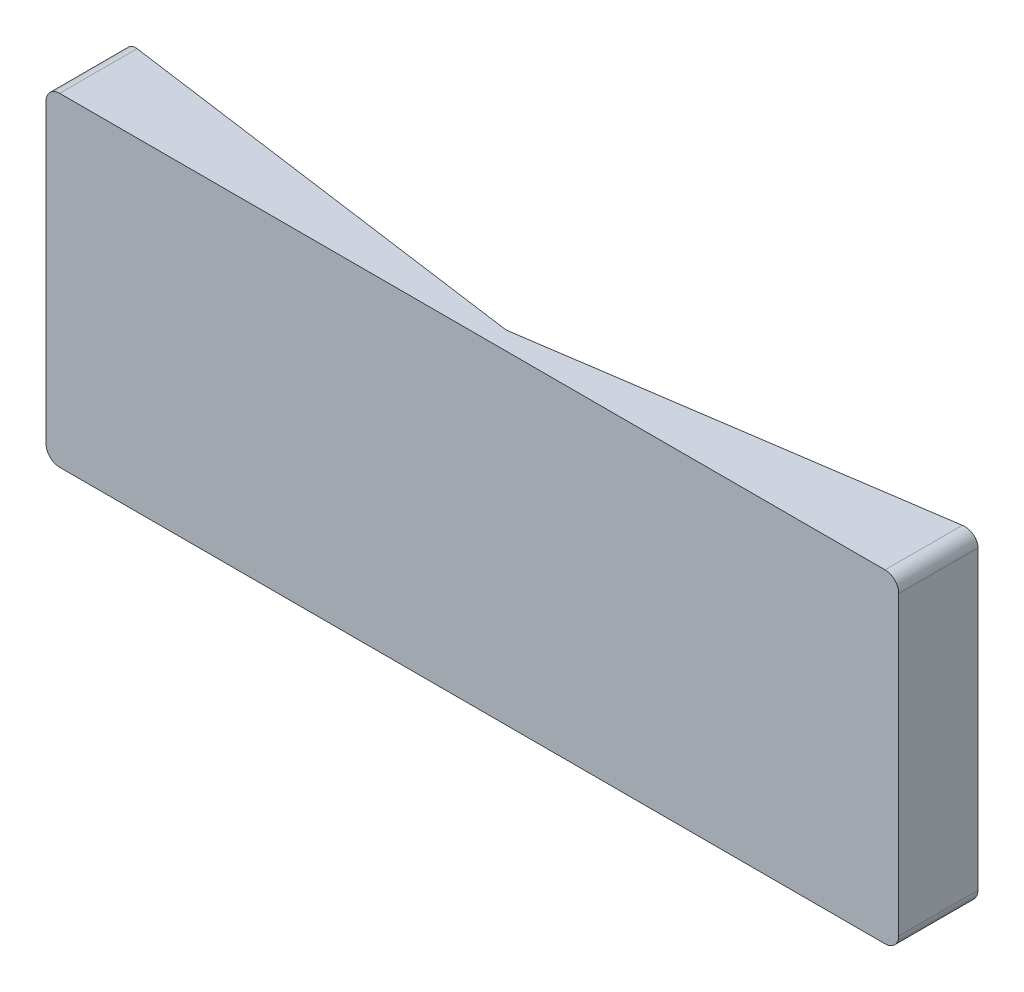
ISO-10303-21;
HEADER;
FILE_DESCRIPTION(('STEP AP214'),'2;1');
FILE_NAME('part.step','',(''),(''),'','','');
FILE_SCHEMA(('AUTOMOTIVE_DESIGN { 1 0 10303 214 1 1 1 1 }'));
ENDSEC;
DATA;
#1=APPLICATION_CONTEXT('core data for automotive mechanical design processes');
#2=APPLICATION_PROTOCOL_DEFINITION('international standard','automotive_design',2000,#1);
#3=PRODUCT_CONTEXT('',#1,'mechanical');
#4=PRODUCT('Part','Part','',(#3));
#5=PRODUCT_RELATED_PRODUCT_CATEGORY('part','',(#4));
#6=PRODUCT_DEFINITION_FORMATION('','',#4);
#7=PRODUCT_DEFINITION_CONTEXT('part definition',#1,'design');
#8=PRODUCT_DEFINITION('design','',#6,#7);
#9=PRODUCT_DEFINITION_SHAPE('','',#8);
#10=(LENGTH_UNIT() NAMED_UNIT(*) SI_UNIT(.MILLI.,.METRE.));
#11=(NAMED_UNIT(*) PLANE_ANGLE_UNIT() SI_UNIT($,.RADIAN.));
#12=(NAMED_UNIT(*) SI_UNIT($,.STERADIAN.) SOLID_ANGLE_UNIT());
#13=UNCERTAINTY_MEASURE_WITH_UNIT(LENGTH_MEASURE(1.E-05),#10,'distance_accuracy_value','');
#14=(GEOMETRIC_REPRESENTATION_CONTEXT(3) GLOBAL_UNCERTAINTY_ASSIGNED_CONTEXT((#13)) GLOBAL_UNIT_ASSIGNED_CONTEXT((#10,
#11,#12)) REPRESENTATION_CONTEXT('',''));
#15=CARTESIAN_POINT('',(0.,0.,0.));
#16=DIRECTION('',(0.,0.,1.));
#17=DIRECTION('',(1.,0.,0.));
#18=AXIS2_PLACEMENT_3D('',#15,#16,#17);
#19=CARTESIAN_POINT('',(73.8196902050114,-2.54,14.732));
#20=DIRECTION('',(0.,0.,-1.));
#21=DIRECTION('',(-1.,0.,0.));
#22=AXIS2_PLACEMENT_3D('',#19,#20,#21);
#23=CYLINDRICAL_SURFACE('',#22,2.54);
#24=CARTESIAN_POINT('',(73.8196902050114,-2.54,0.377191341160366));
#25=DIRECTION('',(-0.146889724137514,0.,-0.989152874404561));
#26=DIRECTION('',(0.989152874404561,0.,-0.146889724137514));
#27=AXIS2_PLACEMENT_3D('',#24,#25,#26);
#28=ELLIPSE('',#27,2.56785383303769,2.54);
#29=CARTESIAN_POINT('',(73.8196902050114,0.,0.37719134116037));
#30=VERTEX_POINT('',#29);
#31=CARTESIAN_POINT('',(76.3596902050114,-2.54000000000001,0.));
#32=VERTEX_POINT('',#31);
#33=EDGE_CURVE('E179',#30,#32,#28,.T.);
#34=ORIENTED_EDGE('',*,*,#33,.F.);
#35=DIRECTION('',(0.,0.,-1.));
#36=VECTOR('',#35,1.);
#37=CARTESIAN_POINT('',(73.8196902050114,0.,14.732));
#38=LINE('',#37,#36);
#39=CARTESIAN_POINT('',(73.8196902050114,0.,14.732));
#40=VERTEX_POINT('',#39);
#41=EDGE_CURVE('E165',#40,#30,#38,.T.);
#42=ORIENTED_EDGE('',*,*,#41,.F.);
#43=CARTESIAN_POINT('',(73.8196902050114,-2.54,14.732));
#44=DIRECTION('',(0.,0.,1.));
#45=DIRECTION('',(1.,0.,0.));
#46=AXIS2_PLACEMENT_3D('',#43,#44,#45);
#47=CIRCLE('',#46,2.54);
#48=CARTESIAN_POINT('',(76.3596902050114,-2.54000000000002,14.732));
#49=VERTEX_POINT('',#48);
#50=EDGE_CURVE('E151',#49,#40,#47,.T.);
#51=ORIENTED_EDGE('',*,*,#50,.F.);
#52=DIRECTION('',(0.,0.,-1.));
#53=VECTOR('',#52,1.);
#54=CARTESIAN_POINT('',(76.3596902050114,-2.54000000000002,14.732));
#55=LINE('',#54,#53);
#56=EDGE_CURVE('E141',#49,#32,#55,.T.);
#57=ORIENTED_EDGE('',*,*,#56,.T.);
#58=EDGE_LOOP('',(#34,#42,#51,#57));
#59=FACE_BOUND('',#58,.T.);
#60=ADVANCED_FACE('F38',(#59),#23,.T.);
#61=CARTESIAN_POINT('',(-79.5963097949886,0.,14.732));
#62=DIRECTION('',(0.,-1.,0.));
#63=DIRECTION('',(0.,0.,-1.));
#64=AXIS2_PLACEMENT_3D('',#61,#62,#63);
#65=PLANE('',#64);
#66=DIRECTION('',(0.989152874404561,0.,-0.146889724137514));
#67=VECTOR('',#66,1.);
#68=CARTESIAN_POINT('',(-78.3718174195553,0.,22.9777105829431));
#69=LINE('',#68,#67);
#70=CARTESIAN_POINT('',(0.,5.99999999337242E-06,11.3394543145741));
#71=VERTEX_POINT('',#70);
#72=EDGE_CURVE('E176',#71,#30,#69,.T.);
#73=ORIENTED_EDGE('',*,*,#72,.F.);
#74=DIRECTION('',(0.990604294125408,0.,0.136759396241361));
#75=VECTOR('',#74,1.);
#76=CARTESIAN_POINT('',(-77.6480062250653,0.,0.619639638159038));
#77=LINE('',#76,#75);
#78=CARTESIAN_POINT('',(-79.5963097949886,0.,0.350663598485353));
#79=VERTEX_POINT('',#78);
#80=EDGE_CURVE('E170',#79,#71,#77,.T.);
#81=ORIENTED_EDGE('',*,*,#80,.F.);
#82=DIRECTION('',(0.,0.,-1.));
#83=VECTOR('',#82,1.);
#84=CARTESIAN_POINT('',(-79.5963097949886,0.,14.732));
#85=LINE('',#84,#83);
#86=CARTESIAN_POINT('',(-79.5963097949886,0.,14.732));
#87=VERTEX_POINT('',#86);
#88=EDGE_CURVE('E162',#87,#79,#85,.T.);
#89=ORIENTED_EDGE('',*,*,#88,.F.);
#90=DIRECTION('',(-1.,0.,0.));
#91=VECTOR('',#90,1.);
#92=CARTESIAN_POINT('',(-79.5963097949886,0.,14.732));
#93=LINE('',#92,#91);
#94=EDGE_CURVE('E224',#40,#87,#93,.T.);
#95=ORIENTED_EDGE('',*,*,#94,.F.);
#96=ORIENTED_EDGE('',*,*,#41,.T.);
#97=EDGE_LOOP('',(#73,#81,#89,#95,#96));
#98=FACE_BOUND('',#97,.T.);
#99=ADVANCED_FACE('F218',(#98),#65,.F.);
#100=CARTESIAN_POINT('',(-79.5963097949886,-2.54,14.732));
#101=DIRECTION('',(0.,0.,-1.));
#102=DIRECTION('',(-1.,0.,0.));
#103=AXIS2_PLACEMENT_3D('',#100,#101,#102);
#104=CYLINDRICAL_SURFACE('',#103,2.54);
#105=CARTESIAN_POINT('',(-79.5963097949886,-2.54,0.350663598485351));
#106=DIRECTION('',(0.136759396241361,0.,-0.990604294125408));
#107=DIRECTION('',(-0.990604294125408,0.,-0.136759396241361));
#108=AXIS2_PLACEMENT_3D('',#105,#106,#107);
#109=ELLIPSE('',#108,2.56409144909122,2.54);
#110=CARTESIAN_POINT('',(-82.1363097949886,-2.54000000000003,0.));
#111=VERTEX_POINT('',#110);
#112=EDGE_CURVE('E174',#111,#79,#109,.T.);
#113=ORIENTED_EDGE('',*,*,#112,.F.);
#114=DIRECTION('',(0.,0.,-1.));
#115=VECTOR('',#114,1.);
#116=CARTESIAN_POINT('',(-82.1363097949886,-2.54000000000002,14.732));
#117=LINE('',#116,#115);
#118=CARTESIAN_POINT('',(-82.1363097949886,-2.54000000000002,14.732));
#119=VERTEX_POINT('',#118);
#120=EDGE_CURVE('E159',#119,#111,#117,.T.);
#121=ORIENTED_EDGE('',*,*,#120,.F.);
#122=CARTESIAN_POINT('',(-79.5963097949886,-2.54,14.732));
#123=DIRECTION('',(0.,0.,1.));
#124=DIRECTION('',(1.,0.,0.));
#125=AXIS2_PLACEMENT_3D('',#122,#123,#124);
#126=CIRCLE('',#125,2.54);
#127=EDGE_CURVE('E221',#87,#119,#126,.T.);
#128=ORIENTED_EDGE('',*,*,#127,.F.);
#129=ORIENTED_EDGE('',*,*,#88,.T.);
#130=EDGE_LOOP('',(#113,#121,#128,#129));
#131=FACE_BOUND('',#130,.T.);
#132=ADVANCED_FACE('F220',(#131),#104,.T.);
#133=CARTESIAN_POINT('',(-79.5963097949886,-57.658,14.732));
#134=DIRECTION('',(0.,0.,-1.));
#135=DIRECTION('',(-1.,0.,0.));
#136=AXIS2_PLACEMENT_3D('',#133,#134,#135);
#137=CYLINDRICAL_SURFACE('',#136,2.54);
#138=CARTESIAN_POINT('',(-79.5963097949886,-57.658,0.350663598485354));
#139=DIRECTION('',(0.136759396241361,0.,-0.990604294125408));
#140=DIRECTION('',(-0.990604294125408,0.,-0.136759396241361));
#141=AXIS2_PLACEMENT_3D('',#138,#139,#140);
#142=ELLIPSE('',#141,2.56409144909122,2.54);
#143=CARTESIAN_POINT('',(-79.5963097949885,-60.198,0.350663598485358));
#144=VERTEX_POINT('',#143);
#145=CARTESIAN_POINT('',(-82.1363097949886,-57.658,0.));
#146=VERTEX_POINT('',#145);
#147=EDGE_CURVE('E76',#144,#146,#142,.T.);
#148=ORIENTED_EDGE('',*,*,#147,.F.);
#149=DIRECTION('',(0.,0.,-1.));
#150=VECTOR('',#149,1.);
#151=CARTESIAN_POINT('',(-79.5963097949886,-60.198,14.732));
#152=LINE('',#151,#150);
#153=CARTESIAN_POINT('',(-79.5963097949886,-60.198,14.732));
#154=VERTEX_POINT('',#153);
#155=EDGE_CURVE('E135',#154,#144,#152,.T.);
#156=ORIENTED_EDGE('',*,*,#155,.F.);
#157=CARTESIAN_POINT('',(-79.5963097949886,-57.658,14.732));
#158=DIRECTION('',(0.,0.,1.));
#159=DIRECTION('',(1.,0.,0.));
#160=AXIS2_PLACEMENT_3D('',#157,#158,#159);
#161=CIRCLE('',#160,2.54);
#162=CARTESIAN_POINT('',(-82.1363097949886,-57.658,14.732));
#163=VERTEX_POINT('',#162);
#164=EDGE_CURVE('E120',#163,#154,#161,.T.);
#165=ORIENTED_EDGE('',*,*,#164,.F.);
#166=DIRECTION('',(0.,0.,-1.));
#167=VECTOR('',#166,1.);
#168=CARTESIAN_POINT('',(-82.1363097949886,-57.658,14.732));
#169=LINE('',#168,#167);
#170=EDGE_CURVE('E156',#163,#146,#169,.T.);
#171=ORIENTED_EDGE('',*,*,#170,.T.);
#172=EDGE_LOOP('',(#148,#156,#165,#171));
#173=FACE_BOUND('',#172,.T.);
#174=ADVANCED_FACE('F280',(#173),#137,.T.);
#175=CARTESIAN_POINT('',(-79.5963097949886,-60.198,14.732));
#176=DIRECTION('',(0.,1.,0.));
#177=DIRECTION('',(0.,0.,1.));
#178=AXIS2_PLACEMENT_3D('',#175,#176,#177);
#179=PLANE('',#178);
#180=DIRECTION('',(-0.989152874404561,0.,0.146889724137514));
#181=VECTOR('',#180,1.);
#182=CARTESIAN_POINT('',(76.3596902050114,-60.198,0.));
#183=LINE('',#182,#181);
#184=CARTESIAN_POINT('',(73.8196902050114,-60.198,0.377191341160361));
#185=VERTEX_POINT('',#184);
#186=CARTESIAN_POINT('',(0.,-60.198,11.3394543145741));
#187=VERTEX_POINT('',#186);
#188=EDGE_CURVE('E132',#185,#187,#183,.T.);
#189=ORIENTED_EDGE('',*,*,#188,.F.);
#190=DIRECTION('',(0.,0.,-1.));
#191=VECTOR('',#190,1.);
#192=CARTESIAN_POINT('',(73.8196902050114,-60.198,14.732));
#193=LINE('',#192,#191);
#194=CARTESIAN_POINT('',(73.8196902050114,-60.198,14.732));
#195=VERTEX_POINT('',#194);
#196=EDGE_CURVE('E127',#195,#185,#193,.T.);
#197=ORIENTED_EDGE('',*,*,#196,.F.);
#198=DIRECTION('',(1.,0.,0.));
#199=VECTOR('',#198,1.);
#200=CARTESIAN_POINT('',(-79.5963097949886,-60.198,14.732));
#201=LINE('',#200,#199);
#202=EDGE_CURVE('E113',#154,#195,#201,.T.);
#203=ORIENTED_EDGE('',*,*,#202,.F.);
#204=ORIENTED_EDGE('',*,*,#155,.T.);
#205=DIRECTION('',(-0.990604294125408,0.,-0.136759396241361));
#206=VECTOR('',#205,1.);
#207=CARTESIAN_POINT('',(0.,-60.198,11.3394543145741));
#208=LINE('',#207,#206);
#209=EDGE_CURVE('E186',#187,#144,#208,.T.);
#210=ORIENTED_EDGE('',*,*,#209,.F.);
#211=EDGE_LOOP('',(#189,#197,#203,#204,#210));
#212=FACE_BOUND('',#211,.T.);
#213=ADVANCED_FACE('F128',(#212),#179,.F.);
#214=CARTESIAN_POINT('',(73.8196902050114,-57.658,14.732));
#215=DIRECTION('',(0.,0.,-1.));
#216=DIRECTION('',(-1.,0.,0.));
#217=AXIS2_PLACEMENT_3D('',#214,#215,#216);
#218=CYLINDRICAL_SURFACE('',#217,2.54);
#219=CARTESIAN_POINT('',(73.8196902050114,-57.658,0.377191341160363));
#220=DIRECTION('',(-0.146889724137514,0.,-0.989152874404561));
#221=DIRECTION('',(0.989152874404561,0.,-0.146889724137514));
#222=AXIS2_PLACEMENT_3D('',#219,#220,#221);
#223=ELLIPSE('',#222,2.56785383303769,2.54);
#224=CARTESIAN_POINT('',(76.3596902050114,-57.658,0.));
#225=VERTEX_POINT('',#224);
#226=EDGE_CURVE('E180',#225,#185,#223,.T.);
#227=ORIENTED_EDGE('',*,*,#226,.F.);
#228=DIRECTION('',(0.,0.,-1.));
#229=VECTOR('',#228,1.);
#230=CARTESIAN_POINT('',(76.3596902050114,-57.658,14.732));
#231=LINE('',#230,#229);
#232=CARTESIAN_POINT('',(76.3596902050114,-57.658,14.732));
#233=VERTEX_POINT('',#232);
#234=EDGE_CURVE('E136',#233,#225,#231,.T.);
#235=ORIENTED_EDGE('',*,*,#234,.F.);
#236=CARTESIAN_POINT('',(73.8196902050114,-57.658,14.732));
#237=DIRECTION('',(0.,0.,1.));
#238=DIRECTION('',(1.,0.,0.));
#239=AXIS2_PLACEMENT_3D('',#236,#237,#238);
#240=CIRCLE('',#239,2.54);
#241=EDGE_CURVE('E117',#195,#233,#240,.T.);
#242=ORIENTED_EDGE('',*,*,#241,.F.);
#243=ORIENTED_EDGE('',*,*,#196,.T.);
#244=EDGE_LOOP('',(#227,#235,#242,#243));
#245=FACE_BOUND('',#244,.T.);
#246=ADVANCED_FACE('F138',(#245),#218,.T.);
#247=CARTESIAN_POINT('',(-82.1363097949886,-2.54000000000002,14.732));
#248=DIRECTION('',(1.,0.,0.));
#249=DIRECTION('',(0.,1.,0.));
#250=AXIS2_PLACEMENT_3D('',#247,#248,#249);
#251=PLANE('',#250);
#252=DIRECTION('',(0.,-1.,0.));
#253=VECTOR('',#252,1.);
#254=CARTESIAN_POINT('',(-82.1363097949886,-2.54000000000002,0.));
#255=LINE('',#254,#253);
#256=EDGE_CURVE('E145',#111,#146,#255,.T.);
#257=ORIENTED_EDGE('',*,*,#256,.T.);
#258=ORIENTED_EDGE('',*,*,#170,.F.);
#259=DIRECTION('',(0.,-1.,0.));
#260=VECTOR('',#259,1.);
#261=CARTESIAN_POINT('',(-82.1363097949886,-2.54000000000002,14.732));
#262=LINE('',#261,#260);
#263=EDGE_CURVE('E223',#119,#163,#262,.T.);
#264=ORIENTED_EDGE('',*,*,#263,.F.);
#265=ORIENTED_EDGE('',*,*,#120,.T.);
#266=EDGE_LOOP('',(#257,#258,#264,#265));
#267=FACE_BOUND('',#266,.T.);
#268=ADVANCED_FACE('F283',(#267),#251,.F.);
#269=CARTESIAN_POINT('',(76.3596902050114,-57.658,14.732));
#270=DIRECTION('',(-1.,0.,0.));
#271=DIRECTION('',(0.,-1.,0.));
#272=AXIS2_PLACEMENT_3D('',#269,#270,#271);
#273=PLANE('',#272);
#274=DIRECTION('',(0.,1.,0.));
#275=VECTOR('',#274,1.);
#276=CARTESIAN_POINT('',(76.3596902050114,-57.658,0.));
#277=LINE('',#276,#275);
#278=EDGE_CURVE('E147',#225,#32,#277,.T.);
#279=ORIENTED_EDGE('',*,*,#278,.T.);
#280=ORIENTED_EDGE('',*,*,#56,.F.);
#281=DIRECTION('',(0.,1.,0.));
#282=VECTOR('',#281,1.);
#283=CARTESIAN_POINT('',(76.3596902050114,-57.658,14.732));
#284=LINE('',#283,#282);
#285=EDGE_CURVE('E63',#233,#49,#284,.T.);
#286=ORIENTED_EDGE('',*,*,#285,.F.);
#287=ORIENTED_EDGE('',*,*,#234,.T.);
#288=EDGE_LOOP('',(#279,#280,#286,#287));
#289=FACE_BOUND('',#288,.T.);
#290=ADVANCED_FACE('F285',(#289),#273,.F.);
#291=CARTESIAN_POINT('',(73.8196902050114,-2.54,14.732));
#292=DIRECTION('',(0.,0.,1.));
#293=DIRECTION('',(1.,0.,0.));
#294=AXIS2_PLACEMENT_3D('',#291,#292,#293);
#295=PLANE('',#294);
#296=ORIENTED_EDGE('',*,*,#50,.T.);
#297=ORIENTED_EDGE('',*,*,#94,.T.);
#298=ORIENTED_EDGE('',*,*,#127,.T.);
#299=ORIENTED_EDGE('',*,*,#263,.T.);
#300=ORIENTED_EDGE('',*,*,#164,.T.);
#301=ORIENTED_EDGE('',*,*,#202,.T.);
#302=ORIENTED_EDGE('',*,*,#241,.T.);
#303=ORIENTED_EDGE('',*,*,#285,.T.);
#304=EDGE_LOOP('',(#296,#297,#298,#299,#300,#301,#302,#303));
#305=FACE_BOUND('',#304,.T.);
#306=ADVANCED_FACE('F115',(#305),#295,.T.);
#307=CARTESIAN_POINT('',(0.,-60.198,11.3394543145741));
#308=DIRECTION('',(0.136759396241361,0.,-0.990604294125408));
#309=DIRECTION('',(-0.990604294125408,0.,-0.136759396241361));
#310=AXIS2_PLACEMENT_3D('',#307,#308,#309);
#311=PLANE('',#310);
#312=ORIENTED_EDGE('',*,*,#80,.T.);
#313=DIRECTION('',(0.,1.,0.));
#314=VECTOR('',#313,1.);
#315=CARTESIAN_POINT('',(0.,-60.198,11.3394543145741));
#316=LINE('',#315,#314);
#317=CARTESIAN_POINT('',(0.,-2.54000000000001,11.3394543145741));
#318=VERTEX_POINT('',#317);
#319=EDGE_CURVE('E181',#318,#71,#316,.T.);
#320=ORIENTED_EDGE('',*,*,#319,.F.);
#321=DIRECTION('',(0.990604294125408,0.,0.136759396241361));
#322=VECTOR('',#321,1.);
#323=CARTESIAN_POINT('',(-77.6480062250653,-2.54,0.619639638159038));
#324=LINE('',#323,#322);
#325=CARTESIAN_POINT('',(-79.5963097949886,-2.54,0.350663598485351));
#326=VERTEX_POINT('',#325);
#327=EDGE_CURVE('E204',#326,#318,#324,.T.);
#328=ORIENTED_EDGE('',*,*,#327,.F.);
#329=DIRECTION('',(0.,1.,0.));
#330=VECTOR('',#329,1.);
#331=CARTESIAN_POINT('',(-79.5963097949886,-2.54000000000002,0.350663598485351));
#332=LINE('',#331,#330);
#333=CARTESIAN_POINT('',(-79.5963097949886,-57.658,0.350663598485352));
#334=VERTEX_POINT('',#333);
#335=EDGE_CURVE('E201',#334,#326,#332,.T.);
#336=ORIENTED_EDGE('',*,*,#335,.F.);
#337=DIRECTION('',(-0.990604294125408,0.,-0.136759396241361));
#338=VECTOR('',#337,1.);
#339=CARTESIAN_POINT('',(-77.6480062250652,-57.658,0.619639638159039));
#340=LINE('',#339,#338);
#341=CARTESIAN_POINT('',(0.,-57.658,11.3394543145741));
#342=VERTEX_POINT('',#341);
#343=EDGE_CURVE('E11',#342,#334,#340,.T.);
#344=ORIENTED_EDGE('',*,*,#343,.F.);
#345=EDGE_CURVE('E185',#187,#342,#316,.T.);
#346=ORIENTED_EDGE('',*,*,#345,.F.);
#347=ORIENTED_EDGE('',*,*,#209,.T.);
#348=ORIENTED_EDGE('',*,*,#147,.T.);
#349=ORIENTED_EDGE('',*,*,#256,.F.);
#350=ORIENTED_EDGE('',*,*,#112,.T.);
#351=EDGE_LOOP('',(#312,#320,#328,#336,#344,#346,#347,#348,#349,#350));
#352=FACE_BOUND('',#351,.T.);
#353=ADVANCED_FACE('F209',(#352),#311,.T.);
#354=CARTESIAN_POINT('',(76.3596902050114,-60.198,0.));
#355=DIRECTION('',(-0.146889724137514,0.,-0.989152874404561));
#356=DIRECTION('',(-0.989152874404561,0.,0.146889724137514));
#357=AXIS2_PLACEMENT_3D('',#354,#355,#356);
#358=PLANE('',#357);
#359=ORIENTED_EDGE('',*,*,#33,.T.);
#360=ORIENTED_EDGE('',*,*,#278,.F.);
#361=ORIENTED_EDGE('',*,*,#226,.T.);
#362=ORIENTED_EDGE('',*,*,#188,.T.);
#363=ORIENTED_EDGE('',*,*,#345,.T.);
#364=DIRECTION('',(-0.989152874404561,0.,0.146889724137514));
#365=VECTOR('',#364,1.);
#366=CARTESIAN_POINT('',(-78.3718174195553,-57.658,22.9777105829431));
#367=LINE('',#366,#365);
#368=CARTESIAN_POINT('',(73.8196902050114,-57.658,0.377191341160365));
#369=VERTEX_POINT('',#368);
#370=EDGE_CURVE('E54',#369,#342,#367,.T.);
#371=ORIENTED_EDGE('',*,*,#370,.F.);
#372=DIRECTION('',(0.,-1.,0.));
#373=VECTOR('',#372,1.);
#374=CARTESIAN_POINT('',(73.8196902050114,-57.658,0.377191341160363));
#375=LINE('',#374,#373);
#376=CARTESIAN_POINT('',(73.8196902050114,-2.54,0.377191341160367));
#377=VERTEX_POINT('',#376);
#378=EDGE_CURVE('E46',#377,#369,#375,.T.);
#379=ORIENTED_EDGE('',*,*,#378,.F.);
#380=DIRECTION('',(0.989152874404561,0.,-0.146889724137514));
#381=VECTOR('',#380,1.);
#382=CARTESIAN_POINT('',(-78.3718174195553,-2.54,22.9777105829431));
#383=LINE('',#382,#381);
#384=EDGE_CURVE('E194',#318,#377,#383,.T.);
#385=ORIENTED_EDGE('',*,*,#384,.F.);
#386=ORIENTED_EDGE('',*,*,#319,.T.);
#387=ORIENTED_EDGE('',*,*,#72,.T.);
#388=EDGE_LOOP('',(#359,#360,#361,#362,#363,#371,#379,#385,#386,#387));
#389=FACE_BOUND('',#388,.T.);
#390=ADVANCED_FACE('F305',(#389),#358,.T.);
#391=CARTESIAN_POINT('',(73.8196902050114,-2.54,12.192));
#392=DIRECTION('',(0.,0.,1.));
#393=DIRECTION('',(1.,0.,0.));
#394=AXIS2_PLACEMENT_3D('',#391,#392,#393);
#395=PLANE('',#394);
#396=DIRECTION('',(0.,1.,0.));
#397=VECTOR('',#396,1.);
#398=CARTESIAN_POINT('',(73.8196902050114,-57.658,12.192));
#399=LINE('',#398,#397);
#400=CARTESIAN_POINT('',(73.8196902050114,-57.658,12.192));
#401=VERTEX_POINT('',#400);
#402=CARTESIAN_POINT('',(73.8196902050114,-2.54,12.192));
#403=VERTEX_POINT('',#402);
#404=EDGE_CURVE('E230',#401,#403,#399,.T.);
#405=ORIENTED_EDGE('',*,*,#404,.F.);
#406=DIRECTION('',(1.,0.,0.));
#407=VECTOR('',#406,1.);
#408=CARTESIAN_POINT('',(-79.5963097949886,-57.658,12.192));
#409=LINE('',#408,#407);
#410=CARTESIAN_POINT('',(-79.5963097949886,-57.658,12.192));
#411=VERTEX_POINT('',#410);
#412=EDGE_CURVE('E233',#411,#401,#409,.T.);
#413=ORIENTED_EDGE('',*,*,#412,.F.);
#414=DIRECTION('',(0.,-1.,0.));
#415=VECTOR('',#414,1.);
#416=CARTESIAN_POINT('',(-79.5963097949886,-2.54000000000002,12.192));
#417=LINE('',#416,#415);
#418=CARTESIAN_POINT('',(-79.5963097949886,-2.54,12.192));
#419=VERTEX_POINT('',#418);
#420=EDGE_CURVE('E236',#419,#411,#417,.T.);
#421=ORIENTED_EDGE('',*,*,#420,.F.);
#422=DIRECTION('',(-1.,0.,0.));
#423=VECTOR('',#422,1.);
#424=CARTESIAN_POINT('',(-79.5963097949886,-2.54,12.192));
#425=LINE('',#424,#423);
#426=EDGE_CURVE('E88',#403,#419,#425,.T.);
#427=ORIENTED_EDGE('',*,*,#426,.F.);
#428=EDGE_LOOP('',(#405,#413,#421,#427));
#429=FACE_BOUND('',#428,.T.);
#430=ADVANCED_FACE('F311',(#429),#395,.F.);
#431=CARTESIAN_POINT('',(73.8196902050114,-57.658,14.732));
#432=DIRECTION('',(-1.,0.,0.));
#433=DIRECTION('',(0.,-1.,0.));
#434=AXIS2_PLACEMENT_3D('',#431,#432,#433);
#435=PLANE('',#434);
#436=DIRECTION('',(0.,0.,-1.));
#437=VECTOR('',#436,1.);
#438=CARTESIAN_POINT('',(73.8196902050114,-2.54,14.732));
#439=LINE('',#438,#437);
#440=EDGE_CURVE('E148',#403,#377,#439,.T.);
#441=ORIENTED_EDGE('',*,*,#440,.T.);
#442=ORIENTED_EDGE('',*,*,#378,.T.);
#443=DIRECTION('',(0.,0.,-1.));
#444=VECTOR('',#443,1.);
#445=CARTESIAN_POINT('',(73.8196902050114,-57.658,14.732));
#446=LINE('',#445,#444);
#447=EDGE_CURVE('E232',#401,#369,#446,.T.);
#448=ORIENTED_EDGE('',*,*,#447,.F.);
#449=ORIENTED_EDGE('',*,*,#404,.T.);
#450=EDGE_LOOP('',(#441,#442,#448,#449));
#451=FACE_BOUND('',#450,.T.);
#452=ADVANCED_FACE('F310',(#451),#435,.T.);
#453=CARTESIAN_POINT('',(-79.5963097949886,-57.658,14.732));
#454=DIRECTION('',(0.,1.,0.));
#455=DIRECTION('',(0.,0.,1.));
#456=AXIS2_PLACEMENT_3D('',#453,#454,#455);
#457=PLANE('',#456);
#458=ORIENTED_EDGE('',*,*,#447,.T.);
#459=ORIENTED_EDGE('',*,*,#370,.T.);
#460=ORIENTED_EDGE('',*,*,#343,.T.);
#461=DIRECTION('',(0.,0.,-1.));
#462=VECTOR('',#461,1.);
#463=CARTESIAN_POINT('',(-79.5963097949886,-57.658,14.732));
#464=LINE('',#463,#462);
#465=EDGE_CURVE('E239',#411,#334,#464,.T.);
#466=ORIENTED_EDGE('',*,*,#465,.F.);
#467=ORIENTED_EDGE('',*,*,#412,.T.);
#468=EDGE_LOOP('',(#458,#459,#460,#466,#467));
#469=FACE_BOUND('',#468,.T.);
#470=ADVANCED_FACE('F263',(#469),#457,.T.);
#471=CARTESIAN_POINT('',(-79.5963097949886,-2.54000000000002,14.732));
#472=DIRECTION('',(1.,0.,0.));
#473=DIRECTION('',(0.,1.,0.));
#474=AXIS2_PLACEMENT_3D('',#471,#472,#473);
#475=PLANE('',#474);
#476=ORIENTED_EDGE('',*,*,#465,.T.);
#477=ORIENTED_EDGE('',*,*,#335,.T.);
#478=DIRECTION('',(0.,0.,-1.));
#479=VECTOR('',#478,1.);
#480=CARTESIAN_POINT('',(-79.5963097949886,-2.54000000000002,14.732));
#481=LINE('',#480,#479);
#482=EDGE_CURVE('E187',#419,#326,#481,.T.);
#483=ORIENTED_EDGE('',*,*,#482,.F.);
#484=ORIENTED_EDGE('',*,*,#420,.T.);
#485=EDGE_LOOP('',(#476,#477,#483,#484));
#486=FACE_BOUND('',#485,.T.);
#487=ADVANCED_FACE('F251',(#486),#475,.T.);
#488=CARTESIAN_POINT('',(-79.5963097949886,-2.54,14.732));
#489=DIRECTION('',(0.,-1.,0.));
#490=DIRECTION('',(0.,0.,-1.));
#491=AXIS2_PLACEMENT_3D('',#488,#489,#490);
#492=PLANE('',#491);
#493=ORIENTED_EDGE('',*,*,#327,.T.);
#494=ORIENTED_EDGE('',*,*,#384,.T.);
#495=ORIENTED_EDGE('',*,*,#440,.F.);
#496=ORIENTED_EDGE('',*,*,#426,.T.);
#497=ORIENTED_EDGE('',*,*,#482,.T.);
#498=EDGE_LOOP('',(#493,#494,#495,#496,#497));
#499=FACE_BOUND('',#498,.T.);
#500=ADVANCED_FACE('F249',(#499),#492,.T.);
#501=CLOSED_SHELL('',(#60,#99,#132,#174,#213,#246,#268,#290,#306,#353,#390,#430,#452,#470,#487,#500));
#502=MANIFOLD_SOLID_BREP('B2',#501);
#503=ADVANCED_BREP_SHAPE_REPRESENTATION('',(#18,#502),#14);
#504=SHAPE_DEFINITION_REPRESENTATION(#9,#503);
ENDSEC;
END-ISO-10303-21;
